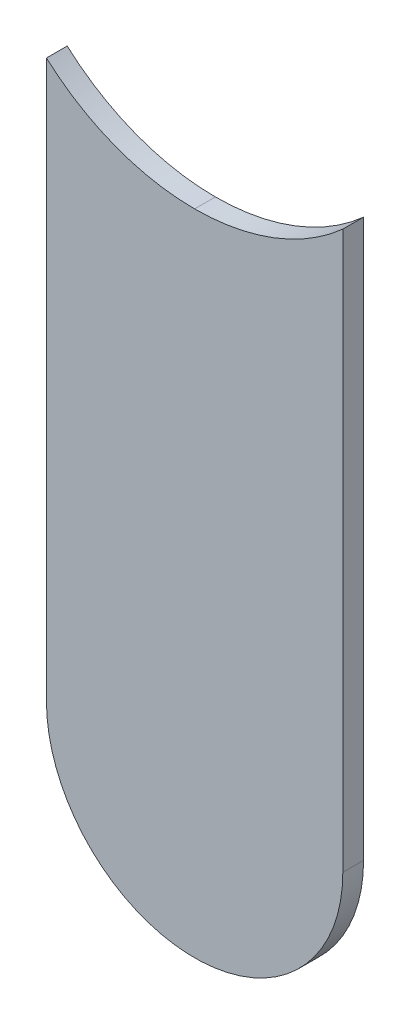
ISO-10303-21;
HEADER;
FILE_DESCRIPTION(('STEP AP214'),'2;1');
FILE_NAME('part.step','',(''),(''),'','','');
FILE_SCHEMA(('AUTOMOTIVE_DESIGN { 1 0 10303 214 1 1 1 1 }'));
ENDSEC;
DATA;
#1=APPLICATION_CONTEXT('core data for automotive mechanical design processes');
#2=APPLICATION_PROTOCOL_DEFINITION('international standard','automotive_design',2000,#1);
#3=PRODUCT_CONTEXT('',#1,'mechanical');
#4=PRODUCT('Part','Part','',(#3));
#5=PRODUCT_RELATED_PRODUCT_CATEGORY('part','',(#4));
#6=PRODUCT_DEFINITION_FORMATION('','',#4);
#7=PRODUCT_DEFINITION_CONTEXT('part definition',#1,'design');
#8=PRODUCT_DEFINITION('design','',#6,#7);
#9=PRODUCT_DEFINITION_SHAPE('','',#8);
#10=(LENGTH_UNIT() NAMED_UNIT(*) SI_UNIT(.MILLI.,.METRE.));
#11=(NAMED_UNIT(*) PLANE_ANGLE_UNIT() SI_UNIT($,.RADIAN.));
#12=(NAMED_UNIT(*) SI_UNIT($,.STERADIAN.) SOLID_ANGLE_UNIT());
#13=UNCERTAINTY_MEASURE_WITH_UNIT(LENGTH_MEASURE(1.E-05),#10,'distance_accuracy_value','');
#14=(GEOMETRIC_REPRESENTATION_CONTEXT(3) GLOBAL_UNCERTAINTY_ASSIGNED_CONTEXT((#13)) GLOBAL_UNIT_ASSIGNED_CONTEXT((#10,
#11,#12)) REPRESENTATION_CONTEXT('',''));
#15=CARTESIAN_POINT('',(0.,0.,0.));
#16=DIRECTION('',(0.,0.,1.));
#17=DIRECTION('',(1.,0.,0.));
#18=AXIS2_PLACEMENT_3D('',#15,#16,#17);
#19=CARTESIAN_POINT('',(144.014,-74.3712,-0.035));
#20=DIRECTION('',(-1.,0.,0.));
#21=DIRECTION('',(0.,0.,1.));
#22=AXIS2_PLACEMENT_3D('',#19,#20,#21);
#23=PLANE('',#22);
#24=DIRECTION('',(0.,0.,-1.));
#25=VECTOR('',#24,1.);
#26=CARTESIAN_POINT('',(144.014,-73.43150849718,-0.045));
#27=LINE('',#26,#25);
#28=CARTESIAN_POINT('',(144.014,-73.43150849719,0.));
#29=VERTEX_POINT('',#28);
#30=CARTESIAN_POINT('',(144.014,-73.43150849719,-0.035));
#31=VERTEX_POINT('',#30);
#32=EDGE_CURVE('E11',#29,#31,#27,.T.);
#33=ORIENTED_EDGE('',*,*,#32,.F.);
#34=DIRECTION('',(0.,1.,0.));
#35=VECTOR('',#34,1.);
#36=CARTESIAN_POINT('',(144.014,-74.3712,0.));
#37=LINE('',#36,#35);
#38=CARTESIAN_POINT('',(144.014,-74.3712,0.));
#39=VERTEX_POINT('',#38);
#40=EDGE_CURVE('E126',#39,#29,#37,.T.);
#41=ORIENTED_EDGE('',*,*,#40,.F.);
#42=DIRECTION('',(0.,0.,1.));
#43=VECTOR('',#42,1.);
#44=CARTESIAN_POINT('',(144.014,-74.3712,-0.035));
#45=LINE('',#44,#43);
#46=CARTESIAN_POINT('',(144.014,-74.3712,-0.035));
#47=VERTEX_POINT('',#46);
#48=EDGE_CURVE('E59',#47,#39,#45,.T.);
#49=ORIENTED_EDGE('',*,*,#48,.F.);
#50=DIRECTION('',(0.,1.,0.));
#51=VECTOR('',#50,1.);
#52=CARTESIAN_POINT('',(144.014,-74.3712,-0.035));
#53=LINE('',#52,#51);
#54=EDGE_CURVE('E119',#47,#31,#53,.T.);
#55=ORIENTED_EDGE('',*,*,#54,.T.);
#56=EDGE_LOOP('',(#33,#41,#49,#55));
#57=FACE_BOUND('',#56,.T.);
#58=ADVANCED_FACE('F17',(#57),#23,.F.);
#59=CARTESIAN_POINT('',(143.764,-73.152,-0.045));
#60=DIRECTION('',(0.,0.,-1.));
#61=DIRECTION('',(0.,-1.,0.));
#62=AXIS2_PLACEMENT_3D('',#59,#60,#61);
#63=CYLINDRICAL_SURFACE('',#62,0.375);
#64=CARTESIAN_POINT('',(143.764,-73.152,-0.035));
#65=DIRECTION('',(0.,0.,-1.));
#66=DIRECTION('',(0.,-1.,0.));
#67=AXIS2_PLACEMENT_3D('',#64,#65,#66);
#68=CIRCLE('',#67,0.375);
#69=CARTESIAN_POINT('',(143.764,-73.527,-0.035));
#70=VERTEX_POINT('',#69);
#71=EDGE_CURVE('E106',#31,#70,#68,.T.);
#72=ORIENTED_EDGE('',*,*,#71,.T.);
#73=DIRECTION('',(0.,0.,1.));
#74=VECTOR('',#73,1.);
#75=CARTESIAN_POINT('',(143.764,-73.527,-0.045));
#76=LINE('',#75,#74);
#77=CARTESIAN_POINT('',(143.764,-73.527,0.));
#78=VERTEX_POINT('',#77);
#79=EDGE_CURVE('E27',#70,#78,#76,.T.);
#80=ORIENTED_EDGE('',*,*,#79,.T.);
#81=CARTESIAN_POINT('',(143.764,-73.152,0.));
#82=DIRECTION('',(0.,0.,-1.));
#83=DIRECTION('',(0.,-1.,0.));
#84=AXIS2_PLACEMENT_3D('',#81,#82,#83);
#85=CIRCLE('',#84,0.375);
#86=EDGE_CURVE('E21',#29,#78,#85,.T.);
#87=ORIENTED_EDGE('',*,*,#86,.F.);
#88=ORIENTED_EDGE('',*,*,#32,.T.);
#89=EDGE_LOOP('',(#72,#80,#87,#88));
#90=FACE_BOUND('',#89,.T.);
#91=ADVANCED_FACE('F161',(#90),#63,.F.);
#92=CARTESIAN_POINT('',(143.764,-73.152,-0.045));
#93=DIRECTION('',(0.,0.,-1.));
#94=DIRECTION('',(0.,-1.,0.));
#95=AXIS2_PLACEMENT_3D('',#92,#93,#94);
#96=CYLINDRICAL_SURFACE('',#95,0.375);
#97=ORIENTED_EDGE('',*,*,#79,.F.);
#98=CARTESIAN_POINT('',(143.764,-73.152,-0.035));
#99=DIRECTION('',(0.,0.,-1.));
#100=DIRECTION('',(0.,-1.,0.));
#101=AXIS2_PLACEMENT_3D('',#98,#99,#100);
#102=CIRCLE('',#101,0.375);
#103=CARTESIAN_POINT('',(143.514,-73.43150849717,-0.035));
#104=VERTEX_POINT('',#103);
#105=EDGE_CURVE('E87',#70,#104,#102,.T.);
#106=ORIENTED_EDGE('',*,*,#105,.T.);
#107=DIRECTION('',(0.,0.,-1.));
#108=VECTOR('',#107,1.);
#109=CARTESIAN_POINT('',(143.514,-73.43150849718,-0.045));
#110=LINE('',#109,#108);
#111=CARTESIAN_POINT('',(143.514,-73.43150849717,0.));
#112=VERTEX_POINT('',#111);
#113=EDGE_CURVE('E90',#112,#104,#110,.T.);
#114=ORIENTED_EDGE('',*,*,#113,.F.);
#115=CARTESIAN_POINT('',(143.764,-73.152,0.));
#116=DIRECTION('',(0.,0.,-1.));
#117=DIRECTION('',(0.,-1.,0.));
#118=AXIS2_PLACEMENT_3D('',#115,#116,#117);
#119=CIRCLE('',#118,0.375);
#120=EDGE_CURVE('E84',#78,#112,#119,.T.);
#121=ORIENTED_EDGE('',*,*,#120,.F.);
#122=EDGE_LOOP('',(#97,#106,#114,#121));
#123=FACE_BOUND('',#122,.T.);
#124=ADVANCED_FACE('F19',(#123),#96,.F.);
#125=CARTESIAN_POINT('',(143.514,-73.152,0.));
#126=DIRECTION('',(0.,0.,1.));
#127=DIRECTION('',(1.,0.,0.));
#128=AXIS2_PLACEMENT_3D('',#125,#126,#127);
#129=PLANE('',#128);
#130=ORIENTED_EDGE('',*,*,#120,.T.);
#131=DIRECTION('',(0.,-1.,0.));
#132=VECTOR('',#131,1.);
#133=CARTESIAN_POINT('',(143.514,-73.152,0.));
#134=LINE('',#133,#132);
#135=CARTESIAN_POINT('',(143.514,-74.3712,0.));
#136=VERTEX_POINT('',#135);
#137=EDGE_CURVE('E109',#112,#136,#134,.T.);
#138=ORIENTED_EDGE('',*,*,#137,.T.);
#139=CARTESIAN_POINT('',(143.764,-74.3712,0.));
#140=DIRECTION('',(0.,0.,1.));
#141=DIRECTION('',(-1.,0.,0.));
#142=AXIS2_PLACEMENT_3D('',#139,#140,#141);
#143=CIRCLE('',#142,0.25);
#144=EDGE_CURVE('E127',#136,#39,#143,.T.);
#145=ORIENTED_EDGE('',*,*,#144,.T.);
#146=ORIENTED_EDGE('',*,*,#40,.T.);
#147=ORIENTED_EDGE('',*,*,#86,.T.);
#148=EDGE_LOOP('',(#130,#138,#145,#146,#147));
#149=FACE_BOUND('',#148,.T.);
#150=ADVANCED_FACE('F160',(#149),#129,.T.);
#151=CARTESIAN_POINT('',(143.764,-74.3712,-0.035));
#152=DIRECTION('',(0.,0.,-1.));
#153=DIRECTION('',(-1.,0.,0.));
#154=AXIS2_PLACEMENT_3D('',#151,#152,#153);
#155=CYLINDRICAL_SURFACE('',#154,0.25);
#156=CARTESIAN_POINT('',(143.764,-74.3712,-0.035));
#157=DIRECTION('',(0.,0.,1.));
#158=DIRECTION('',(-1.,0.,0.));
#159=AXIS2_PLACEMENT_3D('',#156,#157,#158);
#160=CIRCLE('',#159,0.25);
#161=CARTESIAN_POINT('',(143.514,-74.3712,-0.035));
#162=VERTEX_POINT('',#161);
#163=EDGE_CURVE('E95',#162,#47,#160,.T.);
#164=ORIENTED_EDGE('',*,*,#163,.T.);
#165=ORIENTED_EDGE('',*,*,#48,.T.);
#166=ORIENTED_EDGE('',*,*,#144,.F.);
#167=DIRECTION('',(0.,0.,1.));
#168=VECTOR('',#167,1.);
#169=CARTESIAN_POINT('',(143.514,-74.3712,-0.035));
#170=LINE('',#169,#168);
#171=EDGE_CURVE('E116',#162,#136,#170,.T.);
#172=ORIENTED_EDGE('',*,*,#171,.F.);
#173=EDGE_LOOP('',(#164,#165,#166,#172));
#174=FACE_BOUND('',#173,.T.);
#175=ADVANCED_FACE('F150',(#174),#155,.T.);
#176=CARTESIAN_POINT('',(143.514,-73.152,-0.035));
#177=DIRECTION('',(0.,0.,1.));
#178=DIRECTION('',(1.,0.,0.));
#179=AXIS2_PLACEMENT_3D('',#176,#177,#178);
#180=PLANE('',#179);
#181=ORIENTED_EDGE('',*,*,#71,.F.);
#182=ORIENTED_EDGE('',*,*,#54,.F.);
#183=ORIENTED_EDGE('',*,*,#163,.F.);
#184=DIRECTION('',(0.,-1.,0.));
#185=VECTOR('',#184,1.);
#186=CARTESIAN_POINT('',(143.514,-73.152,-0.035));
#187=LINE('',#186,#185);
#188=EDGE_CURVE('E99',#104,#162,#187,.T.);
#189=ORIENTED_EDGE('',*,*,#188,.F.);
#190=ORIENTED_EDGE('',*,*,#105,.F.);
#191=EDGE_LOOP('',(#181,#182,#183,#189,#190));
#192=FACE_BOUND('',#191,.T.);
#193=ADVANCED_FACE('F100',(#192),#180,.F.);
#194=CARTESIAN_POINT('',(143.514,-73.152,-0.035));
#195=DIRECTION('',(1.,0.,0.));
#196=DIRECTION('',(0.,1.,0.));
#197=AXIS2_PLACEMENT_3D('',#194,#195,#196);
#198=PLANE('',#197);
#199=ORIENTED_EDGE('',*,*,#171,.T.);
#200=ORIENTED_EDGE('',*,*,#137,.F.);
#201=ORIENTED_EDGE('',*,*,#113,.T.);
#202=ORIENTED_EDGE('',*,*,#188,.T.);
#203=EDGE_LOOP('',(#199,#200,#201,#202));
#204=FACE_BOUND('',#203,.T.);
#205=ADVANCED_FACE('F108',(#204),#198,.F.);
#206=CLOSED_SHELL('',(#58,#91,#124,#150,#175,#193,#205));
#207=MANIFOLD_SOLID_BREP('B1',#206);
#208=ADVANCED_BREP_SHAPE_REPRESENTATION('',(#18,#207),#14);
#209=SHAPE_DEFINITION_REPRESENTATION(#9,#208);
ENDSEC;
END-ISO-10303-21;
